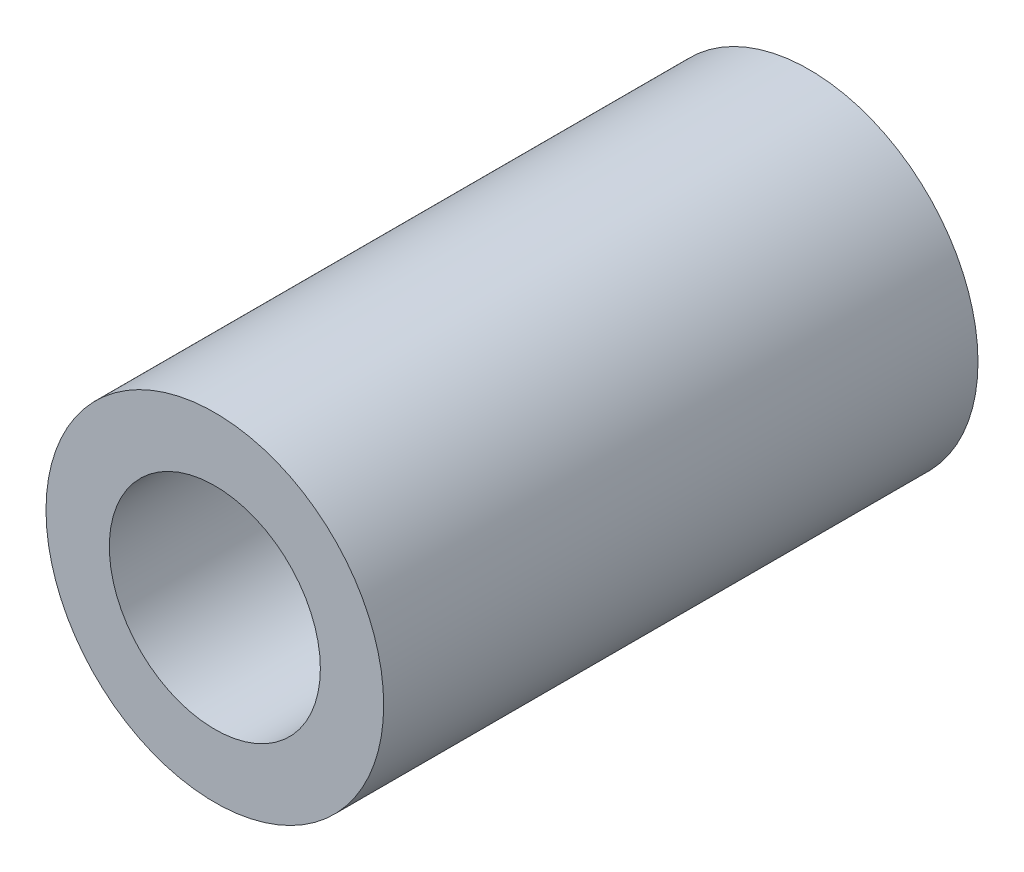
ISO-10303-21;
HEADER;
FILE_DESCRIPTION(('STEP AP214'),'2;1');
FILE_NAME('part.step','',(''),(''),'','','');
FILE_SCHEMA(('AUTOMOTIVE_DESIGN { 1 0 10303 214 1 1 1 1 }'));
ENDSEC;
DATA;
#1=APPLICATION_CONTEXT('core data for automotive mechanical design processes');
#2=APPLICATION_PROTOCOL_DEFINITION('international standard','automotive_design',2000,#1);
#3=PRODUCT_CONTEXT('',#1,'mechanical');
#4=PRODUCT('Part','Part','',(#3));
#5=PRODUCT_RELATED_PRODUCT_CATEGORY('part','',(#4));
#6=PRODUCT_DEFINITION_FORMATION('','',#4);
#7=PRODUCT_DEFINITION_CONTEXT('part definition',#1,'design');
#8=PRODUCT_DEFINITION('design','',#6,#7);
#9=PRODUCT_DEFINITION_SHAPE('','',#8);
#10=(LENGTH_UNIT() NAMED_UNIT(*) SI_UNIT(.MILLI.,.METRE.));
#11=(NAMED_UNIT(*) PLANE_ANGLE_UNIT() SI_UNIT($,.RADIAN.));
#12=(NAMED_UNIT(*) SI_UNIT($,.STERADIAN.) SOLID_ANGLE_UNIT());
#13=UNCERTAINTY_MEASURE_WITH_UNIT(LENGTH_MEASURE(1.E-05),#10,'distance_accuracy_value','');
#14=(GEOMETRIC_REPRESENTATION_CONTEXT(3) GLOBAL_UNCERTAINTY_ASSIGNED_CONTEXT((#13)) GLOBAL_UNIT_ASSIGNED_CONTEXT((#10,
#11,#12)) REPRESENTATION_CONTEXT('',''));
#15=CARTESIAN_POINT('',(0.,0.,0.));
#16=DIRECTION('',(0.,0.,1.));
#17=DIRECTION('',(1.,0.,0.));
#18=AXIS2_PLACEMENT_3D('',#15,#16,#17);
#19=CARTESIAN_POINT('',(0.,0.,5.588));
#20=DIRECTION('',(0.,0.,-1.));
#21=DIRECTION('',(-1.,0.,0.));
#22=AXIS2_PLACEMENT_3D('',#19,#20,#21);
#23=CYLINDRICAL_SURFACE('',#22,1.5875);
#24=CARTESIAN_POINT('',(0.,0.,5.588));
#25=DIRECTION('',(0.,0.,1.));
#26=DIRECTION('',(1.,0.,0.));
#27=AXIS2_PLACEMENT_3D('',#24,#25,#26);
#28=CIRCLE('',#27,1.5875);
#29=CARTESIAN_POINT('',(1.5875,0.,5.588));
#30=VERTEX_POINT('',#29);
#31=EDGE_CURVE('E10',#30,#30,#28,.T.);
#32=ORIENTED_EDGE('',*,*,#31,.F.);
#33=EDGE_LOOP('',(#32));
#34=FACE_BOUND('',#33,.T.);
#35=CARTESIAN_POINT('',(0.,0.,0.));
#36=DIRECTION('',(0.,0.,1.));
#37=DIRECTION('',(1.,0.,0.));
#38=AXIS2_PLACEMENT_3D('',#35,#36,#37);
#39=CIRCLE('',#38,1.5875);
#40=CARTESIAN_POINT('',(1.5875,0.,0.));
#41=VERTEX_POINT('',#40);
#42=EDGE_CURVE('E36',#41,#41,#39,.T.);
#43=ORIENTED_EDGE('',*,*,#42,.T.);
#44=EDGE_LOOP('',(#43));
#45=FACE_BOUND('',#44,.T.);
#46=ADVANCED_FACE('F33',(#34,#45),#23,.T.);
#47=CARTESIAN_POINT('',(0.,0.,5.588));
#48=DIRECTION('',(0.,0.,1.));
#49=DIRECTION('',(1.,0.,0.));
#50=AXIS2_PLACEMENT_3D('',#47,#48,#49);
#51=PLANE('',#50);
#52=CARTESIAN_POINT('',(0.,0.,5.588));
#53=DIRECTION('',(0.,0.,1.));
#54=DIRECTION('',(1.,0.,0.));
#55=AXIS2_PLACEMENT_3D('',#52,#53,#54);
#56=CIRCLE('',#55,0.9921875);
#57=CARTESIAN_POINT('',(0.9921875,0.,5.588));
#58=VERTEX_POINT('',#57);
#59=EDGE_CURVE('E47',#58,#58,#56,.T.);
#60=ORIENTED_EDGE('',*,*,#59,.F.);
#61=EDGE_LOOP('',(#60));
#62=FACE_BOUND('',#61,.T.);
#63=ORIENTED_EDGE('',*,*,#31,.T.);
#64=EDGE_LOOP('',(#63));
#65=FACE_BOUND('',#64,.T.);
#66=ADVANCED_FACE('F54',(#62,#65),#51,.T.);
#67=CARTESIAN_POINT('',(0.,0.,0.));
#68=DIRECTION('',(0.,0.,1.));
#69=DIRECTION('',(1.,0.,0.));
#70=AXIS2_PLACEMENT_3D('',#67,#68,#69);
#71=PLANE('',#70);
#72=CARTESIAN_POINT('',(0.,0.,0.));
#73=DIRECTION('',(0.,0.,1.));
#74=DIRECTION('',(1.,0.,0.));
#75=AXIS2_PLACEMENT_3D('',#72,#73,#74);
#76=CIRCLE('',#75,0.9921875);
#77=CARTESIAN_POINT('',(0.9921875,0.,0.));
#78=VERTEX_POINT('',#77);
#79=EDGE_CURVE('E43',#78,#78,#76,.F.);
#80=ORIENTED_EDGE('',*,*,#79,.F.);
#81=EDGE_LOOP('',(#80));
#82=FACE_BOUND('',#81,.T.);
#83=ORIENTED_EDGE('',*,*,#42,.F.);
#84=EDGE_LOOP('',(#83));
#85=FACE_BOUND('',#84,.T.);
#86=ADVANCED_FACE('F56',(#82,#85),#71,.F.);
#87=CARTESIAN_POINT('',(0.,0.,-0.00100000000000013));
#88=DIRECTION('',(0.,0.,1.));
#89=DIRECTION('',(1.,0.,0.));
#90=AXIS2_PLACEMENT_3D('',#87,#88,#89);
#91=CYLINDRICAL_SURFACE('',#90,0.9921875);
#92=ORIENTED_EDGE('',*,*,#59,.T.);
#93=EDGE_LOOP('',(#92));
#94=FACE_BOUND('',#93,.T.);
#95=ORIENTED_EDGE('',*,*,#79,.T.);
#96=EDGE_LOOP('',(#95));
#97=FACE_BOUND('',#96,.T.);
#98=ADVANCED_FACE('F51',(#94,#97),#91,.F.);
#99=CLOSED_SHELL('',(#46,#66,#86,#98));
#100=MANIFOLD_SOLID_BREP('B2',#99);
#101=ADVANCED_BREP_SHAPE_REPRESENTATION('',(#18,#100),#14);
#102=SHAPE_DEFINITION_REPRESENTATION(#9,#101);
ENDSEC;
END-ISO-10303-21;
